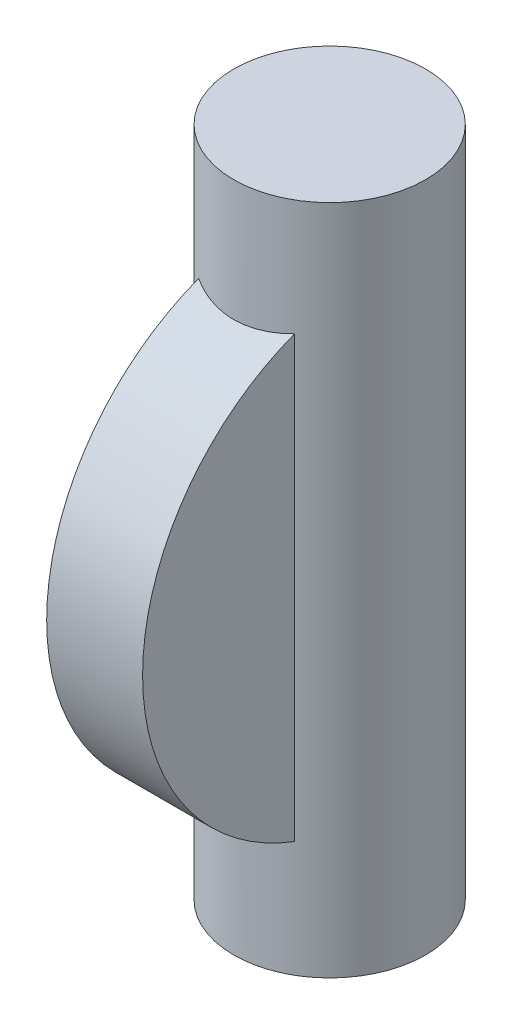
ISO-10303-21;
HEADER;
FILE_DESCRIPTION(('STEP AP214'),'2;1');
FILE_NAME('part.step','',(''),(''),'','','');
FILE_SCHEMA(('AUTOMOTIVE_DESIGN { 1 0 10303 214 1 1 1 1 }'));
ENDSEC;
DATA;
#1=APPLICATION_CONTEXT('core data for automotive mechanical design processes');
#2=APPLICATION_PROTOCOL_DEFINITION('international standard','automotive_design',2000,#1);
#3=PRODUCT_CONTEXT('',#1,'mechanical');
#4=PRODUCT('Part','Part','',(#3));
#5=PRODUCT_RELATED_PRODUCT_CATEGORY('part','',(#4));
#6=PRODUCT_DEFINITION_FORMATION('','',#4);
#7=PRODUCT_DEFINITION_CONTEXT('part definition',#1,'design');
#8=PRODUCT_DEFINITION('design','',#6,#7);
#9=PRODUCT_DEFINITION_SHAPE('','',#8);
#10=(LENGTH_UNIT() NAMED_UNIT(*) SI_UNIT(.MILLI.,.METRE.));
#11=(NAMED_UNIT(*) PLANE_ANGLE_UNIT() SI_UNIT($,.RADIAN.));
#12=(NAMED_UNIT(*) SI_UNIT($,.STERADIAN.) SOLID_ANGLE_UNIT());
#13=UNCERTAINTY_MEASURE_WITH_UNIT(LENGTH_MEASURE(1.E-05),#10,'distance_accuracy_value','');
#14=(GEOMETRIC_REPRESENTATION_CONTEXT(3) GLOBAL_UNCERTAINTY_ASSIGNED_CONTEXT((#13)) GLOBAL_UNIT_ASSIGNED_CONTEXT((#10,
#11,#12)) REPRESENTATION_CONTEXT('',''));
#15=CARTESIAN_POINT('',(0.,0.,0.));
#16=DIRECTION('',(0.,0.,1.));
#17=DIRECTION('',(1.,0.,0.));
#18=AXIS2_PLACEMENT_3D('',#15,#16,#17);
#19=CARTESIAN_POINT('',(0.,17.78,0.));
#20=DIRECTION('',(0.,-1.,0.));
#21=DIRECTION('',(0.,0.,-1.));
#22=AXIS2_PLACEMENT_3D('',#19,#20,#21);
#23=CYLINDRICAL_SURFACE('',#22,2.54);
#24=CARTESIAN_POINT('',(0.,0.,0.));
#25=DIRECTION('',(0.,1.,0.));
#26=DIRECTION('',(0.,0.,1.));
#27=AXIS2_PLACEMENT_3D('',#24,#25,#26);
#28=CIRCLE('',#27,2.54);
#29=CARTESIAN_POINT('',(0.,0.,2.54));
#30=VERTEX_POINT('',#29);
#31=EDGE_CURVE('E100',#30,#30,#28,.T.);
#32=ORIENTED_EDGE('',*,*,#31,.T.);
#33=EDGE_LOOP('',(#32));
#34=FACE_BOUND('',#33,.T.);
#35=CARTESIAN_POINT('',(0.,17.78,0.));
#36=DIRECTION('',(0.,1.,0.));
#37=DIRECTION('',(0.,0.,1.));
#38=AXIS2_PLACEMENT_3D('',#35,#36,#37);
#39=CIRCLE('',#38,2.54);
#40=CARTESIAN_POINT('',(0.,17.78,2.54));
#41=VERTEX_POINT('',#40);
#42=EDGE_CURVE('E64',#41,#41,#39,.T.);
#43=ORIENTED_EDGE('',*,*,#42,.F.);
#44=EDGE_LOOP('',(#43));
#45=FACE_BOUND('',#44,.T.);
#46=DIRECTION('',(0.,-1.,0.));
#47=VECTOR('',#46,1.);
#48=CARTESIAN_POINT('',(-1.27,17.78,2.19970452561247));
#49=LINE('',#48,#47);
#50=CARTESIAN_POINT('',(-1.27,14.7112566512738,2.19970452561247));
#51=VERTEX_POINT('',#50);
#52=CARTESIAN_POINT('',(-1.27,3.06874334872615,2.19970452561247));
#53=VERTEX_POINT('',#52);
#54=EDGE_CURVE('E11',#51,#53,#49,.T.);
#55=ORIENTED_EDGE('',*,*,#54,.F.);
#56=CARTESIAN_POINT('',(0.,14.5710323885716,-2.54));
#57=CARTESIAN_POINT('',(-0.0679155655720305,14.5710337146344,-2.53999844050646));
#58=CARTESIAN_POINT('',(-0.135853569762148,14.5722558814735,-2.5372703167691));
#59=CARTESIAN_POINT('',(-0.271221226461333,14.5770987997238,-2.52639338906266));
#60=CARTESIAN_POINT('',(-0.338650534826577,14.5807210493114,-2.51824119927744));
#61=CARTESIAN_POINT('',(-0.539693567418974,14.5950507345168,-2.48570637087482));
#62=CARTESIAN_POINT('',(-0.671856275803724,14.6092205973638,-2.45324576747276));
#63=CARTESIAN_POINT('',(-0.927802215521276,14.6448991388758,-2.36831960375434));
#64=CARTESIAN_POINT('',(-1.05161640518304,14.6663786878879,-2.31593335260028));
#65=CARTESIAN_POINT('',(-1.28869168847588,14.7142056937984,-2.1928755843071));
#66=CARTESIAN_POINT('',(-1.40195556531598,14.7405518613638,-2.12220890829366));
#67=CARTESIAN_POINT('',(-1.62150470841532,14.796905118006,-1.96008701428142));
#68=CARTESIAN_POINT('',(-1.72708119218214,14.8270331416588,-1.86771414327507));
#69=CARTESIAN_POINT('',(-1.92176793364219,14.8865587708278,-1.66673065906509));
#70=CARTESIAN_POINT('',(-2.01087199039026,14.9159560976877,-1.55811395869108));
#71=CARTESIAN_POINT('',(-2.17364166423992,14.9721676220868,-1.32221208425154));
#72=CARTESIAN_POINT('',(-2.2465170854779,14.9988248607961,-1.19434091167574));
#73=CARTESIAN_POINT('',(-2.36941848184901,15.0450806010899,-0.926870737178497));
#74=CARTESIAN_POINT('',(-2.41945421228399,15.0646821155616,-0.787276772523779));
#75=CARTESIAN_POINT('',(-2.49270943847994,15.0937614377408,-0.507753572710938));
#76=CARTESIAN_POINT('',(-2.51714855260971,15.1036978850658,-0.368192644665041));
#77=CARTESIAN_POINT('',(-2.5424507266891,15.113989234143,-0.0866206654972092));
#78=CARTESIAN_POINT('',(-2.54332294328488,15.1143478572478,0.055389412574953));
#79=CARTESIAN_POINT('',(-2.52212084700829,15.1057178466232,0.328987264892486));
#80=CARTESIAN_POINT('',(-2.50138464934366,15.0972742820658,0.460699094257686));
#81=CARTESIAN_POINT('',(-2.439839015735,15.0727300484544,0.718584032260553));
#82=CARTESIAN_POINT('',(-2.39902810355434,15.0566288162804,0.844756732823289));
#83=CARTESIAN_POINT('',(-2.2979971107209,15.018026997958,1.09027772930769));
#84=CARTESIAN_POINT('',(-2.23749181564043,14.9954329839583,1.20949336387334));
#85=CARTESIAN_POINT('',(-2.09906256194394,14.9460726742474,1.43638950208111));
#86=CARTESIAN_POINT('',(-2.02113253626385,14.9193049262813,1.54406596857104));
#87=CARTESIAN_POINT('',(-1.84389463407868,14.8621500462067,1.75260593970079));
#88=CARTESIAN_POINT('',(-1.74349322636959,14.8316405704135,1.85250789705647));
#89=CARTESIAN_POINT('',(-1.52726700447751,14.771827131676,2.03446104003705));
#90=CARTESIAN_POINT('',(-1.41143673533339,14.7425235999187,2.11650588503086));
#91=CARTESIAN_POINT('',(-1.16316739109928,14.6875876073813,2.2627442198456));
#92=CARTESIAN_POINT('',(-1.03032998669366,14.6620940949051,2.32631808932677));
#93=CARTESIAN_POINT('',(-0.754517305525141,14.619305635495,2.42980640316843));
#94=CARTESIAN_POINT('',(-0.611549010205899,14.6020051045438,2.46973696654542));
#95=CARTESIAN_POINT('',(-0.329147462582528,14.5789308837986,2.52241458803907));
#96=CARTESIAN_POINT('',(-0.190058492382774,14.5724999602969,2.53671503178177));
#97=CARTESIAN_POINT('',(0.0886502374134904,14.5700173496361,2.5422726995924));
#98=CARTESIAN_POINT('',(0.228269810786092,14.5739623061763,2.53353737507082));
#99=CARTESIAN_POINT('',(0.495209720900547,14.5911102171483,2.49468747082768));
#100=CARTESIAN_POINT('',(0.622763850287883,14.6037401802841,2.46589472097989));
#101=CARTESIAN_POINT('',(0.871136249198154,14.6361138116632,2.38947987804791));
#102=CARTESIAN_POINT('',(0.991952978965018,14.6558590984014,2.34185350071161));
#103=CARTESIAN_POINT('',(1.22901300437097,14.7012381958511,2.22692523872823));
#104=CARTESIAN_POINT('',(1.34485897936801,14.7270822128168,2.15888944130358));
#105=CARTESIAN_POINT('',(1.56403169452064,14.7814369151021,2.00581403664751));
#106=CARTESIAN_POINT('',(1.66735314815108,14.809948717543,1.92076728905676));
#107=CARTESIAN_POINT('',(1.86687262430553,14.8690939208298,1.72830846859012));
#108=CARTESIAN_POINT('',(1.96189793766413,14.8997204897089,1.61967386773864));
#109=CARTESIAN_POINT('',(2.13256590216446,14.9575784688431,1.38727905242237));
#110=CARTESIAN_POINT('',(2.20820746607035,14.9848096886087,1.26351799008813));
#111=CARTESIAN_POINT('',(2.33777217276902,15.0329371159256,1.00374227729909));
#112=CARTESIAN_POINT('',(2.39167216045291,15.0538265635689,0.867714750467775));
#113=CARTESIAN_POINT('',(2.47544998172956,15.0868123346982,0.587456059343264));
#114=CARTESIAN_POINT('',(2.50534147028115,15.0989136561007,0.443229608287135));
#115=CARTESIAN_POINT('',(2.53858499876886,15.1124059799847,0.161173246470499));
#116=CARTESIAN_POINT('',(2.54359282121928,15.1144650193544,0.0235690280902437));
#117=CARTESIAN_POINT('',(2.53133776401006,15.1094666923652,-0.250460098207927));
#118=CARTESIAN_POINT('',(2.51407851578016,15.1024108125145,-0.386885194770715));
#119=CARTESIAN_POINT('',(2.45896598832264,15.0803181645393,-0.650056335900987));
#120=CARTESIAN_POINT('',(2.42181101094947,15.0655524120803,-0.776973219254644));
#121=CARTESIAN_POINT('',(2.32870899128387,15.0296396812099,-1.02273778875243));
#122=CARTESIAN_POINT('',(2.27275830729747,15.0084914662684,-1.14158390580604));
#123=CARTESIAN_POINT('',(2.14084126582143,14.9606992555846,-1.37368410803692));
#124=CARTESIAN_POINT('',(2.06409124205232,14.9338516719614,-1.48644994259519));
#125=CARTESIAN_POINT('',(1.89391799156258,14.8778711098137,-1.69797511038717));
#126=CARTESIAN_POINT('',(1.80048889419718,14.8487373286311,-1.79672948987847));
#127=CARTESIAN_POINT('',(1.59244516940227,14.7891073791391,-1.98407386269434));
#128=CARTESIAN_POINT('',(1.47684999916146,14.7586452708256,-2.07159044676929));
#129=CARTESIAN_POINT('',(1.23167420488724,14.7017921938346,-2.22611785611173));
#130=CARTESIAN_POINT('',(1.10208598244594,14.6754034561361,-2.29311746388533));
#131=CARTESIAN_POINT('',(0.833091202587661,14.630281944911,-2.40384873592657));
#132=CARTESIAN_POINT('',(0.693767323679287,14.6114921571685,-2.44775444961009));
#133=CARTESIAN_POINT('',(0.480350707210397,14.5908604932617,-2.49523331886032));
#134=CARTESIAN_POINT('',(0.408544639657021,14.5852438941032,-2.50799285370647));
#135=CARTESIAN_POINT('',(0.263959935422451,14.5767057794607,-2.5272963752547));
#136=CARTESIAN_POINT('',(0.191182047763726,14.5737822976096,-2.53384489700239));
#137=CARTESIAN_POINT('',(0.0788688337448351,14.5714425235546,-2.53908239685828));
#138=CARTESIAN_POINT('',(0.0394382000927927,14.5710316185342,-2.54000090558943));
#139=CARTESIAN_POINT('',(0.,14.5710323885716,-2.54));
#140=B_SPLINE_CURVE_WITH_KNOTS('',3,(#56,#57,#58,#59,#60,#61,#62,#63,#64,#65,#66,#67,#68,#69,
#70,#71,#72,#73,#74,#75,#76,#77,#78,#79,#80,#81,#82,#83,#84,#85,#86,#87,#88,#89,#90,#91,#92,#93,
#94,#95,#96,#97,#98,#99,#100,#101,#102,#103,#104,#105,#106,#107,#108,#109,#110,#111,#112,#113,
#114,#115,#116,#117,#118,#119,#120,#121,#122,#123,#124,#125,#126,#127,#128,#129,#130,#131,#132,
#133,#134,#135,#136,#137,#138,#139),.UNSPECIFIED.,.T.,.F.,(4,2,2,2,2,2,2,2,2,2,2,2,2,2,2,2,2,2,
2,2,2,2,2,2,2,2,2,2,2,2,2,2,2,2,2,2,2,2,2,2,2,4),(0.,0.203712638649048,0.407552558463175,
0.815842424343114,1.22252391578538,1.62909781759079,2.05766182477721,2.48638683522042,
2.93282955331532,3.37908140770325,3.80294093161042,4.22663576742006,4.62556804368743,
5.02452966067109,5.42954723849084,5.8347060583643,6.26742266193142,6.70029266299863,
7.14634307038392,7.59208902808188,8.00976688987415,8.42730966142889,8.81965788287157,
9.21209540662931,9.62080420686393,10.0296849243162,10.4702551126703,10.9108500072302,
11.3519129109091,11.7927247797753,12.2037708224221,12.6147498380145,13.0121683707442,
13.4096639483132,13.8249477080811,14.2403779272758,14.6827295341247,15.1253225631624,
15.5645303398846,15.7837125088946,16.0027345159338,16.1210293388777),.UNSPECIFIED.);
#141=CARTESIAN_POINT('',(1.27,14.7112566512738,2.19970452561247));
#142=VERTEX_POINT('',#141);
#143=EDGE_CURVE('E40',#51,#142,#140,.T.);
#144=ORIENTED_EDGE('',*,*,#143,.T.);
#145=DIRECTION('',(0.,-1.,0.));
#146=VECTOR('',#145,1.);
#147=CARTESIAN_POINT('',(1.27,17.78,2.19970452561247));
#148=LINE('',#147,#146);
#149=CARTESIAN_POINT('',(1.27,3.06874334872615,2.19970452561247));
#150=VERTEX_POINT('',#149);
#151=EDGE_CURVE('E58',#142,#150,#148,.T.);
#152=ORIENTED_EDGE('',*,*,#151,.T.);
#153=CARTESIAN_POINT('',(0.,3.20896761142836,-2.54));
#154=CARTESIAN_POINT('',(0.0679155655720305,3.20896628536558,-2.53999844050646));
#155=CARTESIAN_POINT('',(0.135853569762148,3.20774411852652,-2.5372703167691));
#156=CARTESIAN_POINT('',(0.271221226461333,3.20290120027615,-2.52639338906266));
#157=CARTESIAN_POINT('',(0.338650534826577,3.19927895068856,-2.51824119927744));
#158=CARTESIAN_POINT('',(0.539693567418974,3.1849492654832,-2.48570637087482));
#159=CARTESIAN_POINT('',(0.671856275803724,3.17077940263624,-2.45324576747276));
#160=CARTESIAN_POINT('',(0.927802215521276,3.13510086112424,-2.36831960375434));
#161=CARTESIAN_POINT('',(1.05161640518305,3.11362131211208,-2.31593335260028));
#162=CARTESIAN_POINT('',(1.28869168847588,3.0657943062016,-2.1928755843071));
#163=CARTESIAN_POINT('',(1.40195556531598,3.03944813863619,-2.12220890829366));
#164=CARTESIAN_POINT('',(1.62150470841532,2.98309488199399,-1.96008701428142));
#165=CARTESIAN_POINT('',(1.72708119218214,2.95296685834115,-1.86771414327507));
#166=CARTESIAN_POINT('',(1.92176793364219,2.8934412291722,-1.66673065906509));
#167=CARTESIAN_POINT('',(2.01087199039026,2.86404390231228,-1.55811395869108));
#168=CARTESIAN_POINT('',(2.17364166423992,2.80783237791321,-1.32221208425154));
#169=CARTESIAN_POINT('',(2.2465170854779,2.78117513920386,-1.19434091167574));
#170=CARTESIAN_POINT('',(2.36941848184901,2.73491939891005,-0.926870737178496));
#171=CARTESIAN_POINT('',(2.419454212284,2.71531788443841,-0.787276772523779));
#172=CARTESIAN_POINT('',(2.49270943847994,2.68623856225916,-0.507753572710937));
#173=CARTESIAN_POINT('',(2.51714855260971,2.67630211493422,-0.368192644665041));
#174=CARTESIAN_POINT('',(2.5424507266891,2.66601076585697,-0.0866206654972092));
#175=CARTESIAN_POINT('',(2.54332294328488,2.66565214275218,0.0553894125749528));
#176=CARTESIAN_POINT('',(2.52212084700829,2.67428215337685,0.328987264892486));
#177=CARTESIAN_POINT('',(2.50138464934366,2.68272571793417,0.460699094257686));
#178=CARTESIAN_POINT('',(2.439839015735,2.7072699515456,0.718584032260553));
#179=CARTESIAN_POINT('',(2.39902810355434,2.72337118371963,0.844756732823289));
#180=CARTESIAN_POINT('',(2.2979971107209,2.76197300204203,1.09027772930769));
#181=CARTESIAN_POINT('',(2.23749181564043,2.78456701604172,1.20949336387334));
#182=CARTESIAN_POINT('',(2.09906256194394,2.83392732575261,1.43638950208111));
#183=CARTESIAN_POINT('',(2.02113253626385,2.8606950737187,1.54406596857104));
#184=CARTESIAN_POINT('',(1.84389463407868,2.91784995379334,1.75260593970079));
#185=CARTESIAN_POINT('',(1.74349322636959,2.94835942958653,1.85250789705647));
#186=CARTESIAN_POINT('',(1.52726700447751,3.00817286832399,2.03446104003705));
#187=CARTESIAN_POINT('',(1.41143673533339,3.03747640008134,2.11650588503086));
#188=CARTESIAN_POINT('',(1.16316739109928,3.09241239261871,2.2627442198456));
#189=CARTESIAN_POINT('',(1.03032998669366,3.11790590509489,2.32631808932677));
#190=CARTESIAN_POINT('',(0.75451730552514,3.16069436450505,2.42980640316843));
#191=CARTESIAN_POINT('',(0.611549010205898,3.17799489545622,2.46973696654542));
#192=CARTESIAN_POINT('',(0.329147462582527,3.20106911620144,2.52241458803907));
#193=CARTESIAN_POINT('',(0.190058492382773,3.20750003970313,2.53671503178177));
#194=CARTESIAN_POINT('',(-0.0886502374134913,3.20998265036389,2.5422726995924));
#195=CARTESIAN_POINT('',(-0.228269810786092,3.20603769382372,2.53353737507082));
#196=CARTESIAN_POINT('',(-0.495209720900548,3.18888978285172,2.49468747082768));
#197=CARTESIAN_POINT('',(-0.622763850287883,3.17625981971587,2.46589472097989));
#198=CARTESIAN_POINT('',(-0.871136249198155,3.14388618833679,2.38947987804791));
#199=CARTESIAN_POINT('',(-0.991952978965019,3.1241409015986,2.34185350071161));
#200=CARTESIAN_POINT('',(-1.22901300437097,3.07876180414892,2.22692523872823));
#201=CARTESIAN_POINT('',(-1.34485897936801,3.05291778718321,2.15888944130358));
#202=CARTESIAN_POINT('',(-1.56403169452064,2.99856308489791,2.00581403664751));
#203=CARTESIAN_POINT('',(-1.66735314815108,2.97005128245701,1.92076728905676));
#204=CARTESIAN_POINT('',(-1.86687262430553,2.91090607917022,1.72830846859012));
#205=CARTESIAN_POINT('',(-1.96189793766413,2.88027951029106,1.61967386773863));
#206=CARTESIAN_POINT('',(-2.13256590216446,2.82242153115692,1.38727905242237));
#207=CARTESIAN_POINT('',(-2.20820746607035,2.79519031139126,1.26351799008813));
#208=CARTESIAN_POINT('',(-2.33777217276902,2.74706288407437,1.00374227729909));
#209=CARTESIAN_POINT('',(-2.39167216045292,2.72617343643106,0.867714750467774));
#210=CARTESIAN_POINT('',(-2.47544998172956,2.69318766530181,0.587456059343262));
#211=CARTESIAN_POINT('',(-2.50534147028115,2.68108634389925,0.443229608287134));
#212=CARTESIAN_POINT('',(-2.53858499876886,2.66759402001528,0.161173246470498));
#213=CARTESIAN_POINT('',(-2.54359282121928,2.66553498064558,0.0235690280902428));
#214=CARTESIAN_POINT('',(-2.53133776401006,2.67053330763479,-0.250460098207928));
#215=CARTESIAN_POINT('',(-2.51407851578016,2.67758918748548,-0.386885194770716));
#216=CARTESIAN_POINT('',(-2.45896598832264,2.69968183546067,-0.650056335900988));
#217=CARTESIAN_POINT('',(-2.42181101094947,2.71444758791968,-0.776973219254645));
#218=CARTESIAN_POINT('',(-2.32870899128387,2.75036031879008,-1.02273778875243));
#219=CARTESIAN_POINT('',(-2.27275830729747,2.77150853373157,-1.14158390580604));
#220=CARTESIAN_POINT('',(-2.14084126582142,2.81930074441536,-1.37368410803692));
#221=CARTESIAN_POINT('',(-2.06409124205232,2.84614832803862,-1.48644994259519));
#222=CARTESIAN_POINT('',(-1.89391799156258,2.90212889018633,-1.69797511038717));
#223=CARTESIAN_POINT('',(-1.80048889419718,2.93126267136891,-1.79672948987847));
#224=CARTESIAN_POINT('',(-1.59244516940227,2.99089262086089,-1.98407386269434));
#225=CARTESIAN_POINT('',(-1.47684999916146,3.02135472917436,-2.07159044676929));
#226=CARTESIAN_POINT('',(-1.23167420488724,3.07820780616539,-2.22611785611173));
#227=CARTESIAN_POINT('',(-1.10208598244594,3.10459654386391,-2.29311746388533));
#228=CARTESIAN_POINT('',(-0.83309120258766,3.14971805508903,-2.40384873592657));
#229=CARTESIAN_POINT('',(-0.693767323679285,3.16850784283148,-2.44775444961008));
#230=CARTESIAN_POINT('',(-0.480350707210395,3.18913950673831,-2.49523331886032));
#231=CARTESIAN_POINT('',(-0.408544639657019,3.19475610589675,-2.50799285370647));
#232=CARTESIAN_POINT('',(-0.263959935422449,3.20329422053931,-2.5272963752547));
#233=CARTESIAN_POINT('',(-0.191182047763724,3.20621770239039,-2.53384489700239));
#234=CARTESIAN_POINT('',(-0.0788688337448337,3.20855747644539,-2.53908239685828));
#235=CARTESIAN_POINT('',(-0.039438200092792,3.20896838146581,-2.54000090558943));
#236=CARTESIAN_POINT('',(0.,3.20896761142836,-2.54));
#237=B_SPLINE_CURVE_WITH_KNOTS('',3,(#153,#154,#155,#156,#157,#158,#159,#160,#161,#162,#163,
#164,#165,#166,#167,#168,#169,#170,#171,#172,#173,#174,#175,#176,#177,#178,#179,#180,#181,#182,
#183,#184,#185,#186,#187,#188,#189,#190,#191,#192,#193,#194,#195,#196,#197,#198,#199,#200,#201,
#202,#203,#204,#205,#206,#207,#208,#209,#210,#211,#212,#213,#214,#215,#216,#217,#218,#219,#220,
#221,#222,#223,#224,#225,#226,#227,#228,#229,#230,#231,#232,#233,#234,#235,#236),.UNSPECIFIED.,
.T.,.F.,(4,2,2,2,2,2,2,2,2,2,2,2,2,2,2,2,2,2,2,2,2,2,2,2,2,2,2,2,2,2,2,2,2,2,2,2,2,2,2,2,2,4),
(0.,0.203712638649048,0.407552558463175,0.815842424343114,1.22252391578538,1.62909781759079,
2.05766182477721,2.48638683522042,2.93282955331532,3.37908140770325,3.80294093161042,
4.22663576742006,4.62556804368742,5.02452966067109,5.42954723849084,5.8347060583643,
6.26742266193142,6.70029266299862,7.14634307038392,7.59208902808188,8.00976688987415,
8.42730966142889,8.81965788287157,9.21209540662931,9.62080420686393,10.0296849243162,
10.4702551126703,10.9108500072302,11.3519129109091,11.7927247797753,12.2037708224221,
12.6147498380145,13.0121683707442,13.4096639483132,13.8249477080811,14.2403779272758,
14.6827295341247,15.1253225631624,15.5645303398846,15.7837125088946,16.0027345159338,
16.1210293388776),.UNSPECIFIED.);
#238=EDGE_CURVE('E63',#150,#53,#237,.T.);
#239=ORIENTED_EDGE('',*,*,#238,.T.);
#240=EDGE_LOOP('',(#55,#144,#152,#239));
#241=FACE_BOUND('',#240,.T.);
#242=ADVANCED_FACE('F32',(#34,#45,#241),#23,.T.);
#243=CARTESIAN_POINT('',(0.,17.78,0.));
#244=DIRECTION('',(0.,1.,0.));
#245=DIRECTION('',(0.,0.,1.));
#246=AXIS2_PLACEMENT_3D('',#243,#244,#245);
#247=PLANE('',#246);
#248=ORIENTED_EDGE('',*,*,#42,.T.);
#249=EDGE_LOOP('',(#248));
#250=FACE_BOUND('',#249,.T.);
#251=ADVANCED_FACE('F85',(#250),#247,.T.);
#252=CARTESIAN_POINT('',(0.,0.,0.));
#253=DIRECTION('',(0.,1.,0.));
#254=DIRECTION('',(0.,0.,1.));
#255=AXIS2_PLACEMENT_3D('',#252,#253,#254);
#256=PLANE('',#255);
#257=ORIENTED_EDGE('',*,*,#31,.F.);
#258=EDGE_LOOP('',(#257));
#259=FACE_BOUND('',#258,.T.);
#260=ADVANCED_FACE('F83',(#259),#256,.F.);
#261=CARTESIAN_POINT('',(-1.27,8.89,0.));
#262=DIRECTION('',(1.,0.,0.));
#263=DIRECTION('',(0.,0.,-1.));
#264=AXIS2_PLACEMENT_3D('',#261,#262,#263);
#265=CYLINDRICAL_SURFACE('',#264,6.223);
#266=ORIENTED_EDGE('',*,*,#143,.F.);
#267=CARTESIAN_POINT('',(-1.27,8.89,0.));
#268=DIRECTION('',(1.,0.,0.));
#269=DIRECTION('',(0.,0.,-1.));
#270=AXIS2_PLACEMENT_3D('',#267,#268,#269);
#271=CIRCLE('',#270,6.223);
#272=EDGE_CURVE('E68',#51,#53,#271,.T.);
#273=ORIENTED_EDGE('',*,*,#272,.T.);
#274=ORIENTED_EDGE('',*,*,#238,.F.);
#275=CARTESIAN_POINT('',(1.27,8.89,0.));
#276=DIRECTION('',(1.,0.,0.));
#277=DIRECTION('',(0.,0.,-1.));
#278=AXIS2_PLACEMENT_3D('',#275,#276,#277);
#279=CIRCLE('',#278,6.223);
#280=EDGE_CURVE('E46',#142,#150,#279,.T.);
#281=ORIENTED_EDGE('',*,*,#280,.F.);
#282=EDGE_LOOP('',(#266,#273,#274,#281));
#283=FACE_BOUND('',#282,.T.);
#284=ADVANCED_FACE('F67',(#283),#265,.T.);
#285=CARTESIAN_POINT('',(-1.27,0.,0.));
#286=DIRECTION('',(1.,0.,0.));
#287=DIRECTION('',(0.,0.,-1.));
#288=AXIS2_PLACEMENT_3D('',#285,#286,#287);
#289=PLANE('',#288);
#290=ORIENTED_EDGE('',*,*,#272,.F.);
#291=ORIENTED_EDGE('',*,*,#54,.T.);
#292=EDGE_LOOP('',(#290,#291));
#293=FACE_BOUND('',#292,.T.);
#294=ADVANCED_FACE('F82',(#293),#289,.F.);
#295=CARTESIAN_POINT('',(1.27,0.,0.));
#296=DIRECTION('',(1.,0.,0.));
#297=DIRECTION('',(0.,0.,-1.));
#298=AXIS2_PLACEMENT_3D('',#295,#296,#297);
#299=PLANE('',#298);
#300=ORIENTED_EDGE('',*,*,#151,.F.);
#301=ORIENTED_EDGE('',*,*,#280,.T.);
#302=EDGE_LOOP('',(#300,#301));
#303=FACE_BOUND('',#302,.T.);
#304=ADVANCED_FACE('F59',(#303),#299,.T.);
#305=CLOSED_SHELL('',(#242,#251,#260,#284,#294,#304));
#306=MANIFOLD_SOLID_BREP('B2',#305);
#307=ADVANCED_BREP_SHAPE_REPRESENTATION('',(#18,#306),#14);
#308=SHAPE_DEFINITION_REPRESENTATION(#9,#307);
ENDSEC;
END-ISO-10303-21;
